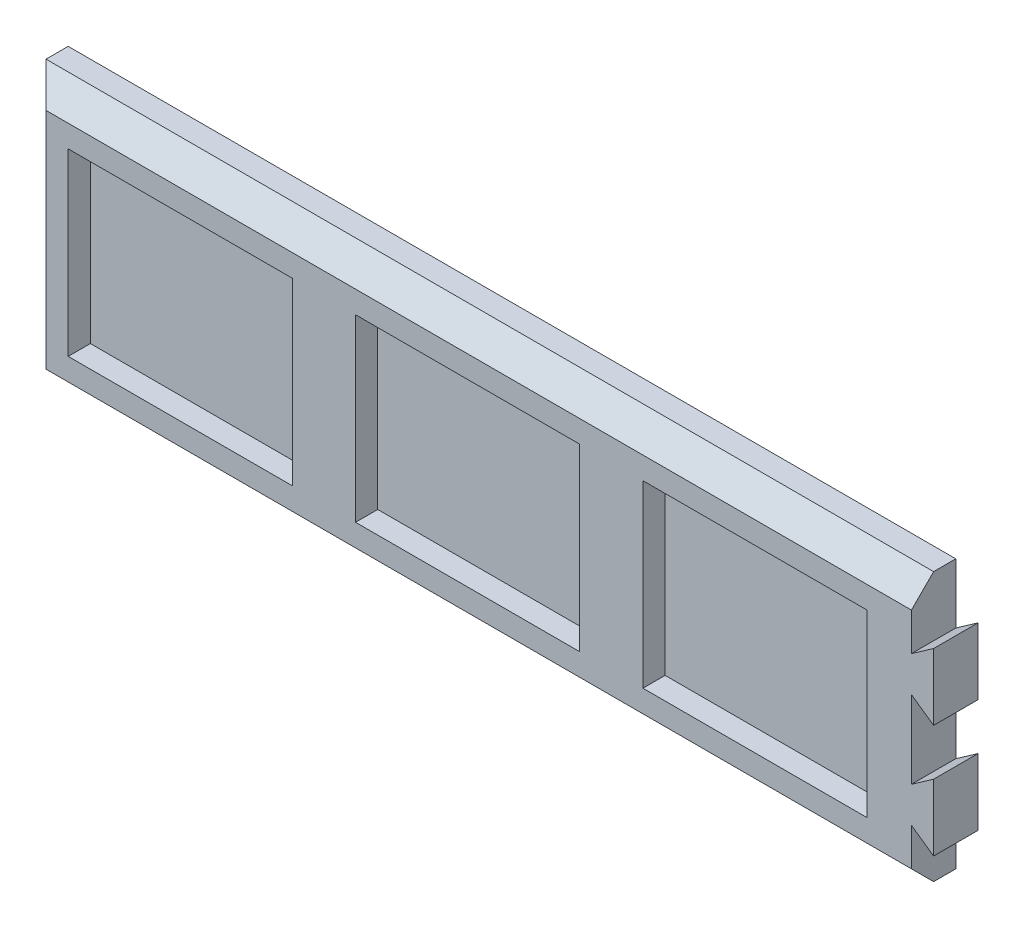
ISO-10303-21;
HEADER;
FILE_DESCRIPTION(('STEP AP214'),'2;1');
FILE_NAME('part.step','',(''),(''),'','','');
FILE_SCHEMA(('AUTOMOTIVE_DESIGN { 1 0 10303 214 1 1 1 1 }'));
ENDSEC;
DATA;
#1=APPLICATION_CONTEXT('core data for automotive mechanical design processes');
#2=APPLICATION_PROTOCOL_DEFINITION('international standard','automotive_design',2000,#1);
#3=PRODUCT_CONTEXT('',#1,'mechanical');
#4=PRODUCT('Part','Part','',(#3));
#5=PRODUCT_RELATED_PRODUCT_CATEGORY('part','',(#4));
#6=PRODUCT_DEFINITION_FORMATION('','',#4);
#7=PRODUCT_DEFINITION_CONTEXT('part definition',#1,'design');
#8=PRODUCT_DEFINITION('design','',#6,#7);
#9=PRODUCT_DEFINITION_SHAPE('','',#8);
#10=(LENGTH_UNIT() NAMED_UNIT(*) SI_UNIT(.MILLI.,.METRE.));
#11=(NAMED_UNIT(*) PLANE_ANGLE_UNIT() SI_UNIT($,.RADIAN.));
#12=(NAMED_UNIT(*) SI_UNIT($,.STERADIAN.) SOLID_ANGLE_UNIT());
#13=UNCERTAINTY_MEASURE_WITH_UNIT(LENGTH_MEASURE(1.E-05),#10,'distance_accuracy_value','');
#14=(GEOMETRIC_REPRESENTATION_CONTEXT(3) GLOBAL_UNCERTAINTY_ASSIGNED_CONTEXT((#13)) GLOBAL_UNIT_ASSIGNED_CONTEXT((#10,
#11,#12)) REPRESENTATION_CONTEXT('',''));
#15=CARTESIAN_POINT('',(0.,0.,0.));
#16=DIRECTION('',(0.,0.,1.));
#17=DIRECTION('',(1.,0.,0.));
#18=AXIS2_PLACEMENT_3D('',#15,#16,#17);
#19=CARTESIAN_POINT('',(200.,30.25,10.));
#20=DIRECTION('',(-1.,0.,0.));
#21=DIRECTION('',(0.,0.,1.));
#22=AXIS2_PLACEMENT_3D('',#19,#20,#21);
#23=PLANE('',#22);
#24=DIRECTION('',(0.,1.,0.));
#25=VECTOR('',#24,1.);
#26=CARTESIAN_POINT('',(200.,30.25,10.));
#27=LINE('',#26,#25);
#28=CARTESIAN_POINT('',(200.,-8.75000000000018,10.));
#29=VERTEX_POINT('',#28);
#30=CARTESIAN_POINT('',(200.,8.75,10.));
#31=VERTEX_POINT('',#30);
#32=EDGE_CURVE('E56',#29,#31,#27,.T.);
#33=ORIENTED_EDGE('',*,*,#32,.F.);
#34=DIRECTION('',(0.,0.,1.));
#35=VECTOR('',#34,1.);
#36=CARTESIAN_POINT('',(200.,-8.75,0.));
#37=LINE('',#36,#35);
#38=CARTESIAN_POINT('',(200.,-8.75,0.));
#39=VERTEX_POINT('',#38);
#40=EDGE_CURVE('E247',#39,#29,#37,.T.);
#41=ORIENTED_EDGE('',*,*,#40,.F.);
#42=DIRECTION('',(0.,1.,0.));
#43=VECTOR('',#42,1.);
#44=CARTESIAN_POINT('',(200.,30.25,0.));
#45=LINE('',#44,#43);
#46=CARTESIAN_POINT('',(200.,8.75,0.));
#47=VERTEX_POINT('',#46);
#48=EDGE_CURVE('E387',#39,#47,#45,.T.);
#49=ORIENTED_EDGE('',*,*,#48,.T.);
#50=DIRECTION('',(0.,0.,1.));
#51=VECTOR('',#50,1.);
#52=CARTESIAN_POINT('',(200.,8.75,0.));
#53=LINE('',#52,#51);
#54=EDGE_CURVE('E261',#47,#31,#53,.T.);
#55=ORIENTED_EDGE('',*,*,#54,.T.);
#56=EDGE_LOOP('',(#33,#41,#49,#55));
#57=FACE_BOUND('',#56,.T.);
#58=ADVANCED_FACE('F38',(#57),#23,.F.);
#59=DIRECTION('',(0.,0.,1.));
#60=VECTOR('',#59,1.);
#61=CARTESIAN_POINT('',(200.,16.75,0.));
#62=LINE('',#61,#60);
#63=CARTESIAN_POINT('',(200.,16.75,0.));
#64=VERTEX_POINT('',#63);
#65=CARTESIAN_POINT('',(200.,16.75,10.));
#66=VERTEX_POINT('',#65);
#67=EDGE_CURVE('E269',#64,#66,#62,.T.);
#68=ORIENTED_EDGE('',*,*,#67,.F.);
#69=CARTESIAN_POINT('',(200.,30.25,0.));
#70=VERTEX_POINT('',#69);
#71=EDGE_CURVE('E383',#64,#70,#45,.T.);
#72=ORIENTED_EDGE('',*,*,#71,.T.);
#73=DIRECTION('',(0.,0.,-1.));
#74=VECTOR('',#73,1.);
#75=CARTESIAN_POINT('',(200.,30.25,10.));
#76=LINE('',#75,#74);
#77=CARTESIAN_POINT('',(200.,30.25,4.99999999999994));
#78=VERTEX_POINT('',#77);
#79=EDGE_CURVE('E391',#78,#70,#76,.T.);
#80=ORIENTED_EDGE('',*,*,#79,.F.);
#81=DIRECTION('',(0.,-0.707106781186546,0.707106781186549));
#82=VECTOR('',#81,1.);
#83=CARTESIAN_POINT('',(200.,25.25,10.));
#84=LINE('',#83,#82);
#85=CARTESIAN_POINT('',(200.,25.25,10.));
#86=VERTEX_POINT('',#85);
#87=EDGE_CURVE('E405',#78,#86,#84,.T.);
#88=ORIENTED_EDGE('',*,*,#87,.T.);
#89=EDGE_CURVE('E377',#66,#86,#27,.T.);
#90=ORIENTED_EDGE('',*,*,#89,.F.);
#91=EDGE_LOOP('',(#68,#72,#80,#88,#90));
#92=FACE_BOUND('',#91,.T.);
#93=ADVANCED_FACE('F434',(#92),#23,.F.);
#94=CARTESIAN_POINT('',(0.,30.25,10.));
#95=DIRECTION('',(1.,0.,0.));
#96=DIRECTION('',(0.,0.,-1.));
#97=AXIS2_PLACEMENT_3D('',#94,#95,#96);
#98=PLANE('',#97);
#99=DIRECTION('',(0.,0.,-1.));
#100=VECTOR('',#99,1.);
#101=CARTESIAN_POINT('',(0.,-30.25,10.));
#102=LINE('',#101,#100);
#103=CARTESIAN_POINT('',(0.,-30.25,4.99999999999994));
#104=VERTEX_POINT('',#103);
#105=CARTESIAN_POINT('',(0.,-30.25,0.));
#106=VERTEX_POINT('',#105);
#107=EDGE_CURVE('E396',#104,#106,#102,.T.);
#108=ORIENTED_EDGE('',*,*,#107,.F.);
#109=DIRECTION('',(0.,1.,0.));
#110=VECTOR('',#109,1.);
#111=CARTESIAN_POINT('',(0.,30.25,4.99999999999994));
#112=LINE('',#111,#110);
#113=CARTESIAN_POINT('',(0.,30.25,4.99999999999994));
#114=VERTEX_POINT('',#113);
#115=EDGE_CURVE('E48',#104,#114,#112,.T.);
#116=ORIENTED_EDGE('',*,*,#115,.T.);
#117=DIRECTION('',(0.,0.,-1.));
#118=VECTOR('',#117,1.);
#119=CARTESIAN_POINT('',(0.,30.25,10.));
#120=LINE('',#119,#118);
#121=CARTESIAN_POINT('',(0.,30.25,0.));
#122=VERTEX_POINT('',#121);
#123=EDGE_CURVE('E376',#114,#122,#120,.T.);
#124=ORIENTED_EDGE('',*,*,#123,.T.);
#125=DIRECTION('',(0.,-1.,0.));
#126=VECTOR('',#125,1.);
#127=CARTESIAN_POINT('',(0.,30.25,0.));
#128=LINE('',#127,#126);
#129=EDGE_CURVE('E304',#122,#106,#128,.T.);
#130=ORIENTED_EDGE('',*,*,#129,.T.);
#131=EDGE_LOOP('',(#108,#116,#124,#130));
#132=FACE_BOUND('',#131,.T.);
#133=ADVANCED_FACE('F469',(#132),#98,.F.);
#134=CARTESIAN_POINT('',(0.,-30.25,10.));
#135=DIRECTION('',(0.,1.,0.));
#136=DIRECTION('',(0.,0.,1.));
#137=AXIS2_PLACEMENT_3D('',#134,#135,#136);
#138=PLANE('',#137);
#139=DIRECTION('',(0.,0.,-1.));
#140=VECTOR('',#139,1.);
#141=CARTESIAN_POINT('',(200.,-30.25,10.));
#142=LINE('',#141,#140);
#143=CARTESIAN_POINT('',(200.,-30.25,4.99999999999994));
#144=VERTEX_POINT('',#143);
#145=CARTESIAN_POINT('',(200.,-30.25,0.));
#146=VERTEX_POINT('',#145);
#147=EDGE_CURVE('E394',#144,#146,#142,.T.);
#148=ORIENTED_EDGE('',*,*,#147,.F.);
#149=DIRECTION('',(-1.,0.,0.));
#150=VECTOR('',#149,1.);
#151=CARTESIAN_POINT('',(0.,-30.25,4.99999999999994));
#152=LINE('',#151,#150);
#153=EDGE_CURVE('E410',#144,#104,#152,.T.);
#154=ORIENTED_EDGE('',*,*,#153,.T.);
#155=ORIENTED_EDGE('',*,*,#107,.T.);
#156=DIRECTION('',(1.,0.,0.));
#157=VECTOR('',#156,1.);
#158=CARTESIAN_POINT('',(0.,-30.25,0.));
#159=LINE('',#158,#157);
#160=EDGE_CURVE('E380',#106,#146,#159,.T.);
#161=ORIENTED_EDGE('',*,*,#160,.T.);
#162=EDGE_LOOP('',(#148,#154,#155,#161));
#163=FACE_BOUND('',#162,.T.);
#164=ADVANCED_FACE('F473',(#163),#138,.F.);
#165=CARTESIAN_POINT('',(200.,-16.7499999999998,0.));
#166=VERTEX_POINT('',#165);
#167=EDGE_CURVE('E384',#146,#166,#45,.T.);
#168=ORIENTED_EDGE('',*,*,#167,.T.);
#169=DIRECTION('',(0.,0.,1.));
#170=VECTOR('',#169,1.);
#171=CARTESIAN_POINT('',(200.,-16.75,0.));
#172=LINE('',#171,#170);
#173=CARTESIAN_POINT('',(200.,-16.7499999999998,10.));
#174=VERTEX_POINT('',#173);
#175=EDGE_CURVE('E64',#166,#174,#172,.T.);
#176=ORIENTED_EDGE('',*,*,#175,.T.);
#177=CARTESIAN_POINT('',(200.,-25.25,10.));
#178=VERTEX_POINT('',#177);
#179=EDGE_CURVE('E374',#178,#174,#27,.T.);
#180=ORIENTED_EDGE('',*,*,#179,.F.);
#181=DIRECTION('',(0.,-0.707106781186546,-0.707106781186549));
#182=VECTOR('',#181,1.);
#183=CARTESIAN_POINT('',(200.,-25.25,10.));
#184=LINE('',#183,#182);
#185=EDGE_CURVE('E408',#178,#144,#184,.T.);
#186=ORIENTED_EDGE('',*,*,#185,.T.);
#187=ORIENTED_EDGE('',*,*,#147,.T.);
#188=EDGE_LOOP('',(#168,#176,#180,#186,#187));
#189=FACE_BOUND('',#188,.T.);
#190=ADVANCED_FACE('F465',(#189),#23,.F.);
#191=CARTESIAN_POINT('',(0.,30.25,10.));
#192=DIRECTION('',(0.,-1.,0.));
#193=DIRECTION('',(0.,0.,-1.));
#194=AXIS2_PLACEMENT_3D('',#191,#192,#193);
#195=PLANE('',#194);
#196=ORIENTED_EDGE('',*,*,#123,.F.);
#197=DIRECTION('',(1.,0.,0.));
#198=VECTOR('',#197,1.);
#199=CARTESIAN_POINT('',(200.,30.25,4.99999999999994));
#200=LINE('',#199,#198);
#201=EDGE_CURVE('E11',#114,#78,#200,.T.);
#202=ORIENTED_EDGE('',*,*,#201,.T.);
#203=ORIENTED_EDGE('',*,*,#79,.T.);
#204=DIRECTION('',(-1.,0.,0.));
#205=VECTOR('',#204,1.);
#206=CARTESIAN_POINT('',(0.,30.25,0.));
#207=LINE('',#206,#205);
#208=EDGE_CURVE('E386',#70,#122,#207,.T.);
#209=ORIENTED_EDGE('',*,*,#208,.T.);
#210=EDGE_LOOP('',(#196,#202,#203,#209));
#211=FACE_BOUND('',#210,.T.);
#212=ADVANCED_FACE('F430',(#211),#195,.F.);
#213=CARTESIAN_POINT('',(0.,0.,10.));
#214=DIRECTION('',(0.,0.,1.));
#215=DIRECTION('',(1.,0.,0.));
#216=AXIS2_PLACEMENT_3D('',#213,#214,#215);
#217=PLANE('',#216);
#218=DIRECTION('',(0.,-1.,0.));
#219=VECTOR('',#218,1.);
#220=CARTESIAN_POINT('',(10.,20.25,10.));
#221=LINE('',#220,#219);
#222=CARTESIAN_POINT('',(10.,20.25,10.));
#223=VERTEX_POINT('',#222);
#224=CARTESIAN_POINT('',(10.,-20.25,10.));
#225=VERTEX_POINT('',#224);
#226=EDGE_CURVE('E291',#223,#225,#221,.T.);
#227=ORIENTED_EDGE('',*,*,#226,.F.);
#228=DIRECTION('',(-1.,0.,0.));
#229=VECTOR('',#228,1.);
#230=CARTESIAN_POINT('',(10.,20.25,10.));
#231=LINE('',#230,#229);
#232=CARTESIAN_POINT('',(60.5,20.25,10.));
#233=VERTEX_POINT('',#232);
#234=EDGE_CURVE('E281',#233,#223,#231,.T.);
#235=ORIENTED_EDGE('',*,*,#234,.F.);
#236=DIRECTION('',(0.,1.,0.));
#237=VECTOR('',#236,1.);
#238=CARTESIAN_POINT('',(60.5,20.25,10.));
#239=LINE('',#238,#237);
#240=CARTESIAN_POINT('',(60.5,-20.25,10.));
#241=VERTEX_POINT('',#240);
#242=EDGE_CURVE('E297',#241,#233,#239,.T.);
#243=ORIENTED_EDGE('',*,*,#242,.F.);
#244=DIRECTION('',(1.,0.,0.));
#245=VECTOR('',#244,1.);
#246=CARTESIAN_POINT('',(10.,-20.25,10.));
#247=LINE('',#246,#245);
#248=EDGE_CURVE('E293',#225,#241,#247,.T.);
#249=ORIENTED_EDGE('',*,*,#248,.F.);
#250=EDGE_LOOP('',(#227,#235,#243,#249));
#251=FACE_BOUND('',#250,.T.);
#252=DIRECTION('',(-1.,0.,0.));
#253=VECTOR('',#252,1.);
#254=CARTESIAN_POINT('',(74.75,20.25,10.));
#255=LINE('',#254,#253);
#256=CARTESIAN_POINT('',(125.25,20.25,10.));
#257=VERTEX_POINT('',#256);
#258=CARTESIAN_POINT('',(74.75,20.25,10.));
#259=VERTEX_POINT('',#258);
#260=EDGE_CURVE('E325',#257,#259,#255,.T.);
#261=ORIENTED_EDGE('',*,*,#260,.F.);
#262=DIRECTION('',(0.,1.,0.));
#263=VECTOR('',#262,1.);
#264=CARTESIAN_POINT('',(125.25,20.25,10.));
#265=LINE('',#264,#263);
#266=CARTESIAN_POINT('',(125.25,-20.25,10.));
#267=VERTEX_POINT('',#266);
#268=EDGE_CURVE('E315',#267,#257,#265,.T.);
#269=ORIENTED_EDGE('',*,*,#268,.F.);
#270=DIRECTION('',(1.,0.,0.));
#271=VECTOR('',#270,1.);
#272=CARTESIAN_POINT('',(74.75,-20.25,10.));
#273=LINE('',#272,#271);
#274=CARTESIAN_POINT('',(74.75,-20.25,10.));
#275=VERTEX_POINT('',#274);
#276=EDGE_CURVE('E331',#275,#267,#273,.T.);
#277=ORIENTED_EDGE('',*,*,#276,.F.);
#278=DIRECTION('',(0.,-1.,0.));
#279=VECTOR('',#278,1.);
#280=CARTESIAN_POINT('',(74.75,20.25,10.));
#281=LINE('',#280,#279);
#282=EDGE_CURVE('E327',#259,#275,#281,.T.);
#283=ORIENTED_EDGE('',*,*,#282,.F.);
#284=EDGE_LOOP('',(#261,#269,#277,#283));
#285=FACE_BOUND('',#284,.T.);
#286=DIRECTION('',(-1.,0.,0.));
#287=VECTOR('',#286,1.);
#288=CARTESIAN_POINT('',(139.5,20.25,10.));
#289=LINE('',#288,#287);
#290=CARTESIAN_POINT('',(190.,20.25,10.));
#291=VERTEX_POINT('',#290);
#292=CARTESIAN_POINT('',(139.5,20.25,10.));
#293=VERTEX_POINT('',#292);
#294=EDGE_CURVE('E357',#291,#293,#289,.T.);
#295=ORIENTED_EDGE('',*,*,#294,.F.);
#296=DIRECTION('',(0.,1.,0.));
#297=VECTOR('',#296,1.);
#298=CARTESIAN_POINT('',(190.,20.25,10.));
#299=LINE('',#298,#297);
#300=CARTESIAN_POINT('',(190.,-20.25,10.));
#301=VERTEX_POINT('',#300);
#302=EDGE_CURVE('E347',#301,#291,#299,.T.);
#303=ORIENTED_EDGE('',*,*,#302,.F.);
#304=DIRECTION('',(1.,0.,0.));
#305=VECTOR('',#304,1.);
#306=CARTESIAN_POINT('',(139.5,-20.25,10.));
#307=LINE('',#306,#305);
#308=CARTESIAN_POINT('',(139.5,-20.25,10.));
#309=VERTEX_POINT('',#308);
#310=EDGE_CURVE('E362',#309,#301,#307,.T.);
#311=ORIENTED_EDGE('',*,*,#310,.F.);
#312=DIRECTION('',(0.,-1.,0.));
#313=VECTOR('',#312,1.);
#314=CARTESIAN_POINT('',(139.5,20.25,10.));
#315=LINE('',#314,#313);
#316=EDGE_CURVE('E359',#293,#309,#315,.T.);
#317=ORIENTED_EDGE('',*,*,#316,.F.);
#318=EDGE_LOOP('',(#295,#303,#311,#317));
#319=FACE_BOUND('',#318,.T.);
#320=DIRECTION('',(0.,-1.,0.));
#321=VECTOR('',#320,1.);
#322=CARTESIAN_POINT('',(5.00000000000005,-30.25,10.));
#323=LINE('',#322,#321);
#324=CARTESIAN_POINT('',(5.00000000000005,25.25,10.));
#325=VERTEX_POINT('',#324);
#326=CARTESIAN_POINT('',(5.00000000000005,-25.25,10.));
#327=VERTEX_POINT('',#326);
#328=EDGE_CURVE('E400',#325,#327,#323,.T.);
#329=ORIENTED_EDGE('',*,*,#328,.T.);
#330=DIRECTION('',(1.,0.,0.));
#331=VECTOR('',#330,1.);
#332=CARTESIAN_POINT('',(200.,-25.25,10.));
#333=LINE('',#332,#331);
#334=EDGE_CURVE('E402',#327,#178,#333,.T.);
#335=ORIENTED_EDGE('',*,*,#334,.T.);
#336=ORIENTED_EDGE('',*,*,#179,.T.);
#337=DIRECTION('',(0.819231920519032,-0.57346234436334,0.));
#338=VECTOR('',#337,1.);
#339=CARTESIAN_POINT('',(205.,-20.25,10.));
#340=LINE('',#339,#338);
#341=CARTESIAN_POINT('',(205.,-20.25,10.));
#342=VERTEX_POINT('',#341);
#343=EDGE_CURVE('E244',#174,#342,#340,.T.);
#344=ORIENTED_EDGE('',*,*,#343,.T.);
#345=DIRECTION('',(0.,1.,0.));
#346=VECTOR('',#345,1.);
#347=CARTESIAN_POINT('',(205.,-5.25,10.));
#348=LINE('',#347,#346);
#349=CARTESIAN_POINT('',(205.,-5.25,10.));
#350=VERTEX_POINT('',#349);
#351=EDGE_CURVE('E221',#342,#350,#348,.T.);
#352=ORIENTED_EDGE('',*,*,#351,.T.);
#353=DIRECTION('',(-0.819231920519044,-0.573462344363323,0.));
#354=VECTOR('',#353,1.);
#355=CARTESIAN_POINT('',(200.,-8.75,10.));
#356=LINE('',#355,#354);
#357=EDGE_CURVE('E238',#350,#29,#356,.T.);
#358=ORIENTED_EDGE('',*,*,#357,.T.);
#359=ORIENTED_EDGE('',*,*,#32,.T.);
#360=DIRECTION('',(0.819231920519041,-0.573462344363328,0.));
#361=VECTOR('',#360,1.);
#362=CARTESIAN_POINT('',(205.,5.25,10.));
#363=LINE('',#362,#361);
#364=CARTESIAN_POINT('',(205.,5.25,10.));
#365=VERTEX_POINT('',#364);
#366=EDGE_CURVE('E249',#31,#365,#363,.T.);
#367=ORIENTED_EDGE('',*,*,#366,.T.);
#368=DIRECTION('',(0.,1.,0.));
#369=VECTOR('',#368,1.);
#370=CARTESIAN_POINT('',(205.,20.25,10.));
#371=LINE('',#370,#369);
#372=CARTESIAN_POINT('',(205.,20.25,10.));
#373=VERTEX_POINT('',#372);
#374=EDGE_CURVE('E264',#365,#373,#371,.T.);
#375=ORIENTED_EDGE('',*,*,#374,.T.);
#376=DIRECTION('',(-0.819231920519041,-0.573462344363328,0.));
#377=VECTOR('',#376,1.);
#378=CARTESIAN_POINT('',(200.,16.75,10.));
#379=LINE('',#378,#377);
#380=EDGE_CURVE('E256',#373,#66,#379,.T.);
#381=ORIENTED_EDGE('',*,*,#380,.T.);
#382=ORIENTED_EDGE('',*,*,#89,.T.);
#383=DIRECTION('',(-1.,0.,0.));
#384=VECTOR('',#383,1.);
#385=CARTESIAN_POINT('',(0.,25.25,10.));
#386=LINE('',#385,#384);
#387=EDGE_CURVE('E398',#86,#325,#386,.T.);
#388=ORIENTED_EDGE('',*,*,#387,.T.);
#389=EDGE_LOOP('',(#329,#335,#336,#344,#352,#358,#359,#367,#375,#381,#382,#388));
#390=FACE_BOUND('',#389,.T.);
#391=ADVANCED_FACE('F449',(#251,#285,#319,#390),#217,.T.);
#392=CARTESIAN_POINT('',(0.,0.,0.));
#393=DIRECTION('',(0.,0.,1.));
#394=DIRECTION('',(1.,0.,0.));
#395=AXIS2_PLACEMENT_3D('',#392,#393,#394);
#396=PLANE('',#395);
#397=ORIENTED_EDGE('',*,*,#129,.F.);
#398=ORIENTED_EDGE('',*,*,#208,.F.);
#399=ORIENTED_EDGE('',*,*,#71,.F.);
#400=DIRECTION('',(-0.819231920519041,-0.573462344363328,0.));
#401=VECTOR('',#400,1.);
#402=CARTESIAN_POINT('',(200.,16.75,0.));
#403=LINE('',#402,#401);
#404=CARTESIAN_POINT('',(205.,20.25,0.));
#405=VERTEX_POINT('',#404);
#406=EDGE_CURVE('E259',#405,#64,#403,.T.);
#407=ORIENTED_EDGE('',*,*,#406,.F.);
#408=DIRECTION('',(0.,1.,0.));
#409=VECTOR('',#408,1.);
#410=CARTESIAN_POINT('',(205.,20.25,0.));
#411=LINE('',#410,#409);
#412=CARTESIAN_POINT('',(205.,5.25,0.));
#413=VERTEX_POINT('',#412);
#414=EDGE_CURVE('E255',#413,#405,#411,.T.);
#415=ORIENTED_EDGE('',*,*,#414,.F.);
#416=DIRECTION('',(0.819231920519041,-0.573462344363328,0.));
#417=VECTOR('',#416,1.);
#418=CARTESIAN_POINT('',(205.,5.25,0.));
#419=LINE('',#418,#417);
#420=EDGE_CURVE('E252',#47,#413,#419,.T.);
#421=ORIENTED_EDGE('',*,*,#420,.F.);
#422=ORIENTED_EDGE('',*,*,#48,.F.);
#423=DIRECTION('',(-0.819231920519044,-0.573462344363323,0.));
#424=VECTOR('',#423,1.);
#425=CARTESIAN_POINT('',(200.,-8.75,0.));
#426=LINE('',#425,#424);
#427=CARTESIAN_POINT('',(205.,-5.25,0.));
#428=VERTEX_POINT('',#427);
#429=EDGE_CURVE('E235',#428,#39,#426,.T.);
#430=ORIENTED_EDGE('',*,*,#429,.F.);
#431=DIRECTION('',(0.,1.,0.));
#432=VECTOR('',#431,1.);
#433=CARTESIAN_POINT('',(205.,-5.25,0.));
#434=LINE('',#433,#432);
#435=CARTESIAN_POINT('',(205.,-20.25,0.));
#436=VERTEX_POINT('',#435);
#437=EDGE_CURVE('E218',#436,#428,#434,.T.);
#438=ORIENTED_EDGE('',*,*,#437,.F.);
#439=DIRECTION('',(0.819231920519032,-0.57346234436334,0.));
#440=VECTOR('',#439,1.);
#441=CARTESIAN_POINT('',(205.,-20.25,0.));
#442=LINE('',#441,#440);
#443=EDGE_CURVE('E233',#166,#436,#442,.T.);
#444=ORIENTED_EDGE('',*,*,#443,.F.);
#445=ORIENTED_EDGE('',*,*,#167,.F.);
#446=ORIENTED_EDGE('',*,*,#160,.F.);
#447=EDGE_LOOP('',(#397,#398,#399,#407,#415,#421,#422,#430,#438,#444,#445,#446));
#448=FACE_BOUND('',#447,.T.);
#449=ADVANCED_FACE('F231',(#448),#396,.F.);
#450=CARTESIAN_POINT('',(139.5,20.25,5.));
#451=DIRECTION('',(0.,1.,0.));
#452=DIRECTION('',(0.,0.,1.));
#453=AXIS2_PLACEMENT_3D('',#450,#451,#452);
#454=PLANE('',#453);
#455=ORIENTED_EDGE('',*,*,#294,.T.);
#456=DIRECTION('',(0.,0.,1.));
#457=VECTOR('',#456,1.);
#458=CARTESIAN_POINT('',(139.5,20.25,5.));
#459=LINE('',#458,#457);
#460=CARTESIAN_POINT('',(139.5,20.25,5.));
#461=VERTEX_POINT('',#460);
#462=EDGE_CURVE('E356',#461,#293,#459,.T.);
#463=ORIENTED_EDGE('',*,*,#462,.F.);
#464=DIRECTION('',(-1.,0.,0.));
#465=VECTOR('',#464,1.);
#466=CARTESIAN_POINT('',(139.5,20.25,5.));
#467=LINE('',#466,#465);
#468=CARTESIAN_POINT('',(190.,20.25,5.));
#469=VERTEX_POINT('',#468);
#470=EDGE_CURVE('E343',#469,#461,#467,.T.);
#471=ORIENTED_EDGE('',*,*,#470,.F.);
#472=DIRECTION('',(0.,0.,1.));
#473=VECTOR('',#472,1.);
#474=CARTESIAN_POINT('',(190.,20.25,5.));
#475=LINE('',#474,#473);
#476=EDGE_CURVE('E328',#469,#291,#475,.T.);
#477=ORIENTED_EDGE('',*,*,#476,.T.);
#478=EDGE_LOOP('',(#455,#463,#471,#477));
#479=FACE_BOUND('',#478,.T.);
#480=ADVANCED_FACE('F529',(#479),#454,.F.);
#481=CARTESIAN_POINT('',(190.,20.25,5.));
#482=DIRECTION('',(1.,0.,0.));
#483=DIRECTION('',(0.,0.,-1.));
#484=AXIS2_PLACEMENT_3D('',#481,#482,#483);
#485=PLANE('',#484);
#486=ORIENTED_EDGE('',*,*,#302,.T.);
#487=ORIENTED_EDGE('',*,*,#476,.F.);
#488=DIRECTION('',(0.,1.,0.));
#489=VECTOR('',#488,1.);
#490=CARTESIAN_POINT('',(190.,20.25,5.));
#491=LINE('',#490,#489);
#492=CARTESIAN_POINT('',(190.,-20.25,5.));
#493=VERTEX_POINT('',#492);
#494=EDGE_CURVE('E353',#493,#469,#491,.T.);
#495=ORIENTED_EDGE('',*,*,#494,.F.);
#496=DIRECTION('',(0.,0.,1.));
#497=VECTOR('',#496,1.);
#498=CARTESIAN_POINT('',(190.,-20.25,5.));
#499=LINE('',#498,#497);
#500=EDGE_CURVE('E368',#493,#301,#499,.T.);
#501=ORIENTED_EDGE('',*,*,#500,.T.);
#502=EDGE_LOOP('',(#486,#487,#495,#501));
#503=FACE_BOUND('',#502,.T.);
#504=ADVANCED_FACE('F726',(#503),#485,.F.);
#505=CARTESIAN_POINT('',(139.5,-20.25,5.));
#506=DIRECTION('',(0.,-1.,0.));
#507=DIRECTION('',(0.,0.,-1.));
#508=AXIS2_PLACEMENT_3D('',#505,#506,#507);
#509=PLANE('',#508);
#510=ORIENTED_EDGE('',*,*,#310,.T.);
#511=ORIENTED_EDGE('',*,*,#500,.F.);
#512=DIRECTION('',(1.,0.,0.));
#513=VECTOR('',#512,1.);
#514=CARTESIAN_POINT('',(139.5,-20.25,5.));
#515=LINE('',#514,#513);
#516=CARTESIAN_POINT('',(139.5,-20.25,5.));
#517=VERTEX_POINT('',#516);
#518=EDGE_CURVE('E350',#517,#493,#515,.T.);
#519=ORIENTED_EDGE('',*,*,#518,.F.);
#520=DIRECTION('',(0.,0.,1.));
#521=VECTOR('',#520,1.);
#522=CARTESIAN_POINT('',(139.5,-20.25,5.));
#523=LINE('',#522,#521);
#524=EDGE_CURVE('E370',#517,#309,#523,.T.);
#525=ORIENTED_EDGE('',*,*,#524,.T.);
#526=EDGE_LOOP('',(#510,#511,#519,#525));
#527=FACE_BOUND('',#526,.T.);
#528=ADVANCED_FACE('F716',(#527),#509,.F.);
#529=CARTESIAN_POINT('',(139.5,20.25,5.));
#530=DIRECTION('',(-1.,0.,0.));
#531=DIRECTION('',(0.,0.,1.));
#532=AXIS2_PLACEMENT_3D('',#529,#530,#531);
#533=PLANE('',#532);
#534=ORIENTED_EDGE('',*,*,#316,.T.);
#535=ORIENTED_EDGE('',*,*,#524,.F.);
#536=DIRECTION('',(0.,-1.,0.));
#537=VECTOR('',#536,1.);
#538=CARTESIAN_POINT('',(139.5,20.25,5.));
#539=LINE('',#538,#537);
#540=EDGE_CURVE('E346',#461,#517,#539,.T.);
#541=ORIENTED_EDGE('',*,*,#540,.F.);
#542=ORIENTED_EDGE('',*,*,#462,.T.);
#543=EDGE_LOOP('',(#534,#535,#541,#542));
#544=FACE_BOUND('',#543,.T.);
#545=ADVANCED_FACE('F706',(#544),#533,.F.);
#546=CARTESIAN_POINT('',(0.,0.,5.));
#547=DIRECTION('',(0.,0.,-1.));
#548=DIRECTION('',(-1.,0.,0.));
#549=AXIS2_PLACEMENT_3D('',#546,#547,#548);
#550=PLANE('',#549);
#551=ORIENTED_EDGE('',*,*,#470,.T.);
#552=ORIENTED_EDGE('',*,*,#540,.T.);
#553=ORIENTED_EDGE('',*,*,#518,.T.);
#554=ORIENTED_EDGE('',*,*,#494,.T.);
#555=EDGE_LOOP('',(#551,#552,#553,#554));
#556=FACE_BOUND('',#555,.T.);
#557=ADVANCED_FACE('F696',(#556),#550,.F.);
#558=CARTESIAN_POINT('',(74.75,20.25,5.));
#559=DIRECTION('',(0.,1.,0.));
#560=DIRECTION('',(0.,0.,1.));
#561=AXIS2_PLACEMENT_3D('',#558,#559,#560);
#562=PLANE('',#561);
#563=ORIENTED_EDGE('',*,*,#260,.T.);
#564=DIRECTION('',(0.,0.,1.));
#565=VECTOR('',#564,1.);
#566=CARTESIAN_POINT('',(74.75,20.25,5.));
#567=LINE('',#566,#565);
#568=CARTESIAN_POINT('',(74.75,20.25,5.));
#569=VERTEX_POINT('',#568);
#570=EDGE_CURVE('E324',#569,#259,#567,.T.);
#571=ORIENTED_EDGE('',*,*,#570,.F.);
#572=DIRECTION('',(-1.,0.,0.));
#573=VECTOR('',#572,1.);
#574=CARTESIAN_POINT('',(74.75,20.25,5.));
#575=LINE('',#574,#573);
#576=CARTESIAN_POINT('',(125.25,20.25,5.));
#577=VERTEX_POINT('',#576);
#578=EDGE_CURVE('E311',#577,#569,#575,.T.);
#579=ORIENTED_EDGE('',*,*,#578,.F.);
#580=DIRECTION('',(0.,0.,1.));
#581=VECTOR('',#580,1.);
#582=CARTESIAN_POINT('',(125.25,20.25,5.));
#583=LINE('',#582,#581);
#584=EDGE_CURVE('E294',#577,#257,#583,.T.);
#585=ORIENTED_EDGE('',*,*,#584,.T.);
#586=EDGE_LOOP('',(#563,#571,#579,#585));
#587=FACE_BOUND('',#586,.T.);
#588=ADVANCED_FACE('F686',(#587),#562,.F.);
#589=CARTESIAN_POINT('',(125.25,20.25,5.));
#590=DIRECTION('',(1.,0.,0.));
#591=DIRECTION('',(0.,0.,-1.));
#592=AXIS2_PLACEMENT_3D('',#589,#590,#591);
#593=PLANE('',#592);
#594=ORIENTED_EDGE('',*,*,#268,.T.);
#595=ORIENTED_EDGE('',*,*,#584,.F.);
#596=DIRECTION('',(0.,1.,0.));
#597=VECTOR('',#596,1.);
#598=CARTESIAN_POINT('',(125.25,20.25,5.));
#599=LINE('',#598,#597);
#600=CARTESIAN_POINT('',(125.25,-20.25,5.));
#601=VERTEX_POINT('',#600);
#602=EDGE_CURVE('E321',#601,#577,#599,.T.);
#603=ORIENTED_EDGE('',*,*,#602,.F.);
#604=DIRECTION('',(0.,0.,1.));
#605=VECTOR('',#604,1.);
#606=CARTESIAN_POINT('',(125.25,-20.25,5.));
#607=LINE('',#606,#605);
#608=EDGE_CURVE('E337',#601,#267,#607,.T.);
#609=ORIENTED_EDGE('',*,*,#608,.T.);
#610=EDGE_LOOP('',(#594,#595,#603,#609));
#611=FACE_BOUND('',#610,.T.);
#612=ADVANCED_FACE('F676',(#611),#593,.F.);
#613=CARTESIAN_POINT('',(74.75,-20.25,5.));
#614=DIRECTION('',(0.,-1.,0.));
#615=DIRECTION('',(0.,0.,-1.));
#616=AXIS2_PLACEMENT_3D('',#613,#614,#615);
#617=PLANE('',#616);
#618=ORIENTED_EDGE('',*,*,#276,.T.);
#619=ORIENTED_EDGE('',*,*,#608,.F.);
#620=DIRECTION('',(1.,0.,0.));
#621=VECTOR('',#620,1.);
#622=CARTESIAN_POINT('',(74.75,-20.25,5.));
#623=LINE('',#622,#621);
#624=CARTESIAN_POINT('',(74.75,-20.25,5.));
#625=VERTEX_POINT('',#624);
#626=EDGE_CURVE('E318',#625,#601,#623,.T.);
#627=ORIENTED_EDGE('',*,*,#626,.F.);
#628=DIRECTION('',(0.,0.,1.));
#629=VECTOR('',#628,1.);
#630=CARTESIAN_POINT('',(74.75,-20.25,5.));
#631=LINE('',#630,#629);
#632=EDGE_CURVE('E339',#625,#275,#631,.T.);
#633=ORIENTED_EDGE('',*,*,#632,.T.);
#634=EDGE_LOOP('',(#618,#619,#627,#633));
#635=FACE_BOUND('',#634,.T.);
#636=ADVANCED_FACE('F666',(#635),#617,.F.);
#637=CARTESIAN_POINT('',(74.75,20.25,5.));
#638=DIRECTION('',(-1.,0.,0.));
#639=DIRECTION('',(0.,0.,1.));
#640=AXIS2_PLACEMENT_3D('',#637,#638,#639);
#641=PLANE('',#640);
#642=ORIENTED_EDGE('',*,*,#282,.T.);
#643=ORIENTED_EDGE('',*,*,#632,.F.);
#644=DIRECTION('',(0.,-1.,0.));
#645=VECTOR('',#644,1.);
#646=CARTESIAN_POINT('',(74.75,20.25,5.));
#647=LINE('',#646,#645);
#648=EDGE_CURVE('E314',#569,#625,#647,.T.);
#649=ORIENTED_EDGE('',*,*,#648,.F.);
#650=ORIENTED_EDGE('',*,*,#570,.T.);
#651=EDGE_LOOP('',(#642,#643,#649,#650));
#652=FACE_BOUND('',#651,.T.);
#653=ADVANCED_FACE('F656',(#652),#641,.F.);
#654=CARTESIAN_POINT('',(0.,0.,5.));
#655=DIRECTION('',(0.,0.,-1.));
#656=DIRECTION('',(-1.,0.,0.));
#657=AXIS2_PLACEMENT_3D('',#654,#655,#656);
#658=PLANE('',#657);
#659=ORIENTED_EDGE('',*,*,#578,.T.);
#660=ORIENTED_EDGE('',*,*,#648,.T.);
#661=ORIENTED_EDGE('',*,*,#626,.T.);
#662=ORIENTED_EDGE('',*,*,#602,.T.);
#663=EDGE_LOOP('',(#659,#660,#661,#662));
#664=FACE_BOUND('',#663,.T.);
#665=ADVANCED_FACE('F646',(#664),#658,.F.);
#666=CARTESIAN_POINT('',(10.,20.25,5.));
#667=DIRECTION('',(-1.,0.,0.));
#668=DIRECTION('',(0.,0.,1.));
#669=AXIS2_PLACEMENT_3D('',#666,#667,#668);
#670=PLANE('',#669);
#671=ORIENTED_EDGE('',*,*,#226,.T.);
#672=DIRECTION('',(0.,0.,1.));
#673=VECTOR('',#672,1.);
#674=CARTESIAN_POINT('',(10.,-20.25,5.));
#675=LINE('',#674,#673);
#676=CARTESIAN_POINT('',(10.,-20.25,5.));
#677=VERTEX_POINT('',#676);
#678=EDGE_CURVE('E290',#677,#225,#675,.T.);
#679=ORIENTED_EDGE('',*,*,#678,.F.);
#680=DIRECTION('',(0.,-1.,0.));
#681=VECTOR('',#680,1.);
#682=CARTESIAN_POINT('',(10.,20.25,5.));
#683=LINE('',#682,#681);
#684=CARTESIAN_POINT('',(10.,20.25,5.));
#685=VERTEX_POINT('',#684);
#686=EDGE_CURVE('E277',#685,#677,#683,.T.);
#687=ORIENTED_EDGE('',*,*,#686,.F.);
#688=DIRECTION('',(0.,0.,1.));
#689=VECTOR('',#688,1.);
#690=CARTESIAN_POINT('',(10.,20.25,5.));
#691=LINE('',#690,#689);
#692=EDGE_CURVE('E302',#685,#223,#691,.T.);
#693=ORIENTED_EDGE('',*,*,#692,.T.);
#694=EDGE_LOOP('',(#671,#679,#687,#693));
#695=FACE_BOUND('',#694,.T.);
#696=ADVANCED_FACE('F636',(#695),#670,.F.);
#697=CARTESIAN_POINT('',(10.,20.25,5.));
#698=DIRECTION('',(0.,1.,0.));
#699=DIRECTION('',(0.,0.,1.));
#700=AXIS2_PLACEMENT_3D('',#697,#698,#699);
#701=PLANE('',#700);
#702=ORIENTED_EDGE('',*,*,#234,.T.);
#703=ORIENTED_EDGE('',*,*,#692,.F.);
#704=DIRECTION('',(-1.,0.,0.));
#705=VECTOR('',#704,1.);
#706=CARTESIAN_POINT('',(10.,20.25,5.));
#707=LINE('',#706,#705);
#708=CARTESIAN_POINT('',(60.5,20.25,5.));
#709=VERTEX_POINT('',#708);
#710=EDGE_CURVE('E287',#709,#685,#707,.T.);
#711=ORIENTED_EDGE('',*,*,#710,.F.);
#712=DIRECTION('',(0.,0.,1.));
#713=VECTOR('',#712,1.);
#714=CARTESIAN_POINT('',(60.5,20.25,5.));
#715=LINE('',#714,#713);
#716=EDGE_CURVE('E305',#709,#233,#715,.T.);
#717=ORIENTED_EDGE('',*,*,#716,.T.);
#718=EDGE_LOOP('',(#702,#703,#711,#717));
#719=FACE_BOUND('',#718,.T.);
#720=ADVANCED_FACE('F626',(#719),#701,.F.);
#721=CARTESIAN_POINT('',(60.5,20.25,5.));
#722=DIRECTION('',(1.,0.,0.));
#723=DIRECTION('',(0.,0.,-1.));
#724=AXIS2_PLACEMENT_3D('',#721,#722,#723);
#725=PLANE('',#724);
#726=ORIENTED_EDGE('',*,*,#242,.T.);
#727=ORIENTED_EDGE('',*,*,#716,.F.);
#728=DIRECTION('',(0.,1.,0.));
#729=VECTOR('',#728,1.);
#730=CARTESIAN_POINT('',(60.5,20.25,5.));
#731=LINE('',#730,#729);
#732=CARTESIAN_POINT('',(60.5,-20.25,5.));
#733=VERTEX_POINT('',#732);
#734=EDGE_CURVE('E284',#733,#709,#731,.T.);
#735=ORIENTED_EDGE('',*,*,#734,.F.);
#736=DIRECTION('',(0.,0.,1.));
#737=VECTOR('',#736,1.);
#738=CARTESIAN_POINT('',(60.5,-20.25,5.));
#739=LINE('',#738,#737);
#740=EDGE_CURVE('E307',#733,#241,#739,.T.);
#741=ORIENTED_EDGE('',*,*,#740,.T.);
#742=EDGE_LOOP('',(#726,#727,#735,#741));
#743=FACE_BOUND('',#742,.T.);
#744=ADVANCED_FACE('F616',(#743),#725,.F.);
#745=CARTESIAN_POINT('',(10.,-20.25,5.));
#746=DIRECTION('',(0.,-1.,0.));
#747=DIRECTION('',(0.,0.,-1.));
#748=AXIS2_PLACEMENT_3D('',#745,#746,#747);
#749=PLANE('',#748);
#750=ORIENTED_EDGE('',*,*,#248,.T.);
#751=ORIENTED_EDGE('',*,*,#740,.F.);
#752=DIRECTION('',(1.,0.,0.));
#753=VECTOR('',#752,1.);
#754=CARTESIAN_POINT('',(10.,-20.25,5.));
#755=LINE('',#754,#753);
#756=EDGE_CURVE('E280',#677,#733,#755,.T.);
#757=ORIENTED_EDGE('',*,*,#756,.F.);
#758=ORIENTED_EDGE('',*,*,#678,.T.);
#759=EDGE_LOOP('',(#750,#751,#757,#758));
#760=FACE_BOUND('',#759,.T.);
#761=ADVANCED_FACE('F606',(#760),#749,.F.);
#762=CARTESIAN_POINT('',(0.,0.,5.));
#763=DIRECTION('',(0.,0.,1.));
#764=DIRECTION('',(1.,0.,0.));
#765=AXIS2_PLACEMENT_3D('',#762,#763,#764);
#766=PLANE('',#765);
#767=ORIENTED_EDGE('',*,*,#686,.T.);
#768=ORIENTED_EDGE('',*,*,#756,.T.);
#769=ORIENTED_EDGE('',*,*,#734,.T.);
#770=ORIENTED_EDGE('',*,*,#710,.T.);
#771=EDGE_LOOP('',(#767,#768,#769,#770));
#772=FACE_BOUND('',#771,.T.);
#773=ADVANCED_FACE('F580',(#772),#766,.T.);
#774=CARTESIAN_POINT('',(0.,25.25,10.));
#775=DIRECTION('',(0.,0.707106781186549,0.707106781186546));
#776=DIRECTION('',(1.,0.,0.));
#777=AXIS2_PLACEMENT_3D('',#774,#775,#776);
#778=PLANE('',#777);
#779=ORIENTED_EDGE('',*,*,#87,.F.);
#780=ORIENTED_EDGE('',*,*,#201,.F.);
#781=DIRECTION('',(0.577350269189625,-0.577350269189625,0.577350269189628));
#782=VECTOR('',#781,1.);
#783=CARTESIAN_POINT('',(3.33333333333337,26.9166666666666,8.33333333333332));
#784=LINE('',#783,#782);
#785=EDGE_CURVE('E43',#325,#114,#784,.F.);
#786=ORIENTED_EDGE('',*,*,#785,.F.);
#787=ORIENTED_EDGE('',*,*,#387,.F.);
#788=EDGE_LOOP('',(#779,#780,#786,#787));
#789=FACE_BOUND('',#788,.T.);
#790=ADVANCED_FACE('F41',(#789),#778,.T.);
#791=CARTESIAN_POINT('',(5.00000000000005,0.,10.));
#792=DIRECTION('',(-0.707106781186549,0.,0.707106781186546));
#793=DIRECTION('',(0.,1.,0.));
#794=AXIS2_PLACEMENT_3D('',#791,#792,#793);
#795=PLANE('',#794);
#796=ORIENTED_EDGE('',*,*,#785,.T.);
#797=ORIENTED_EDGE('',*,*,#115,.F.);
#798=DIRECTION('',(0.577350269189625,0.577350269189625,0.577350269189628));
#799=VECTOR('',#798,1.);
#800=CARTESIAN_POINT('',(13.4166666666667,-16.8333333333333,18.4166666666667));
#801=LINE('',#800,#799);
#802=EDGE_CURVE('E271',#327,#104,#801,.F.);
#803=ORIENTED_EDGE('',*,*,#802,.F.);
#804=ORIENTED_EDGE('',*,*,#328,.F.);
#805=EDGE_LOOP('',(#796,#797,#803,#804));
#806=FACE_BOUND('',#805,.T.);
#807=ADVANCED_FACE('F422',(#806),#795,.T.);
#808=CARTESIAN_POINT('',(0.,-25.25,10.));
#809=DIRECTION('',(0.,-0.707106781186549,0.707106781186546));
#810=DIRECTION('',(-1.,0.,0.));
#811=AXIS2_PLACEMENT_3D('',#808,#809,#810);
#812=PLANE('',#811);
#813=ORIENTED_EDGE('',*,*,#802,.T.);
#814=ORIENTED_EDGE('',*,*,#153,.F.);
#815=ORIENTED_EDGE('',*,*,#185,.F.);
#816=ORIENTED_EDGE('',*,*,#334,.F.);
#817=EDGE_LOOP('',(#813,#814,#815,#816));
#818=FACE_BOUND('',#817,.T.);
#819=ADVANCED_FACE('F454',(#818),#812,.T.);
#820=CARTESIAN_POINT('',(200.,16.75,0.));
#821=DIRECTION('',(-0.573462344363328,0.819231920519041,0.));
#822=DIRECTION('',(-0.819231920519041,-0.573462344363328,0.));
#823=AXIS2_PLACEMENT_3D('',#820,#821,#822);
#824=PLANE('',#823);
#825=ORIENTED_EDGE('',*,*,#380,.F.);
#826=DIRECTION('',(0.,0.,1.));
#827=VECTOR('',#826,1.);
#828=CARTESIAN_POINT('',(205.,20.25,0.));
#829=LINE('',#828,#827);
#830=EDGE_CURVE('E272',#405,#373,#829,.T.);
#831=ORIENTED_EDGE('',*,*,#830,.F.);
#832=ORIENTED_EDGE('',*,*,#406,.T.);
#833=ORIENTED_EDGE('',*,*,#67,.T.);
#834=EDGE_LOOP('',(#825,#831,#832,#833));
#835=FACE_BOUND('',#834,.T.);
#836=ADVANCED_FACE('F452',(#835),#824,.T.);
#837=CARTESIAN_POINT('',(205.,20.25,0.));
#838=DIRECTION('',(1.,0.,0.));
#839=DIRECTION('',(0.,0.,-1.));
#840=AXIS2_PLACEMENT_3D('',#837,#838,#839);
#841=PLANE('',#840);
#842=ORIENTED_EDGE('',*,*,#374,.F.);
#843=DIRECTION('',(0.,0.,1.));
#844=VECTOR('',#843,1.);
#845=CARTESIAN_POINT('',(205.,5.25,0.));
#846=LINE('',#845,#844);
#847=EDGE_CURVE('E274',#413,#365,#846,.T.);
#848=ORIENTED_EDGE('',*,*,#847,.F.);
#849=ORIENTED_EDGE('',*,*,#414,.T.);
#850=ORIENTED_EDGE('',*,*,#830,.T.);
#851=EDGE_LOOP('',(#842,#848,#849,#850));
#852=FACE_BOUND('',#851,.T.);
#853=ADVANCED_FACE('F446',(#852),#841,.T.);
#854=CARTESIAN_POINT('',(205.,5.25,0.));
#855=DIRECTION('',(-0.573462344363328,-0.819231920519041,0.));
#856=DIRECTION('',(0.819231920519041,-0.573462344363328,0.));
#857=AXIS2_PLACEMENT_3D('',#854,#855,#856);
#858=PLANE('',#857);
#859=ORIENTED_EDGE('',*,*,#366,.F.);
#860=ORIENTED_EDGE('',*,*,#54,.F.);
#861=ORIENTED_EDGE('',*,*,#420,.T.);
#862=ORIENTED_EDGE('',*,*,#847,.T.);
#863=EDGE_LOOP('',(#859,#860,#861,#862));
#864=FACE_BOUND('',#863,.T.);
#865=ADVANCED_FACE('F442',(#864),#858,.T.);
#866=CARTESIAN_POINT('',(200.,-8.75,0.));
#867=DIRECTION('',(-0.573462344363323,0.819231920519044,0.));
#868=DIRECTION('',(-0.819231920519044,-0.573462344363323,0.));
#869=AXIS2_PLACEMENT_3D('',#866,#867,#868);
#870=PLANE('',#869);
#871=ORIENTED_EDGE('',*,*,#357,.F.);
#872=DIRECTION('',(0.,0.,1.));
#873=VECTOR('',#872,1.);
#874=CARTESIAN_POINT('',(205.,-5.25,0.));
#875=LINE('',#874,#873);
#876=EDGE_CURVE('E226',#428,#350,#875,.T.);
#877=ORIENTED_EDGE('',*,*,#876,.F.);
#878=ORIENTED_EDGE('',*,*,#429,.T.);
#879=ORIENTED_EDGE('',*,*,#40,.T.);
#880=EDGE_LOOP('',(#871,#877,#878,#879));
#881=FACE_BOUND('',#880,.T.);
#882=ADVANCED_FACE('F484',(#881),#870,.T.);
#883=CARTESIAN_POINT('',(205.,-5.25,0.));
#884=DIRECTION('',(1.,0.,0.));
#885=DIRECTION('',(0.,1.,0.));
#886=AXIS2_PLACEMENT_3D('',#883,#884,#885);
#887=PLANE('',#886);
#888=ORIENTED_EDGE('',*,*,#351,.F.);
#889=DIRECTION('',(0.,0.,1.));
#890=VECTOR('',#889,1.);
#891=CARTESIAN_POINT('',(205.,-20.25,0.));
#892=LINE('',#891,#890);
#893=EDGE_CURVE('E215',#436,#342,#892,.T.);
#894=ORIENTED_EDGE('',*,*,#893,.F.);
#895=ORIENTED_EDGE('',*,*,#437,.T.);
#896=ORIENTED_EDGE('',*,*,#876,.T.);
#897=EDGE_LOOP('',(#888,#894,#895,#896));
#898=FACE_BOUND('',#897,.T.);
#899=ADVANCED_FACE('F217',(#898),#887,.T.);
#900=CARTESIAN_POINT('',(205.,-20.25,0.));
#901=DIRECTION('',(-0.57346234436334,-0.819231920519032,0.));
#902=DIRECTION('',(0.819231920519032,-0.57346234436334,0.));
#903=AXIS2_PLACEMENT_3D('',#900,#901,#902);
#904=PLANE('',#903);
#905=ORIENTED_EDGE('',*,*,#343,.F.);
#906=ORIENTED_EDGE('',*,*,#175,.F.);
#907=ORIENTED_EDGE('',*,*,#443,.T.);
#908=ORIENTED_EDGE('',*,*,#893,.T.);
#909=EDGE_LOOP('',(#905,#906,#907,#908));
#910=FACE_BOUND('',#909,.T.);
#911=ADVANCED_FACE('F237',(#910),#904,.T.);
#912=CLOSED_SHELL('',(#58,#93,#133,#164,#190,#212,#391,#449,#480,#504,#528,#545,#557,#588,#612,
#636,#653,#665,#696,#720,#744,#761,#773,#790,#807,#819,#836,#853,#865,#882,#899,#911));
#913=MANIFOLD_SOLID_BREP('B2',#912);
#914=ADVANCED_BREP_SHAPE_REPRESENTATION('',(#18,#913),#14);
#915=SHAPE_DEFINITION_REPRESENTATION(#9,#914);
ENDSEC;
END-ISO-10303-21;
